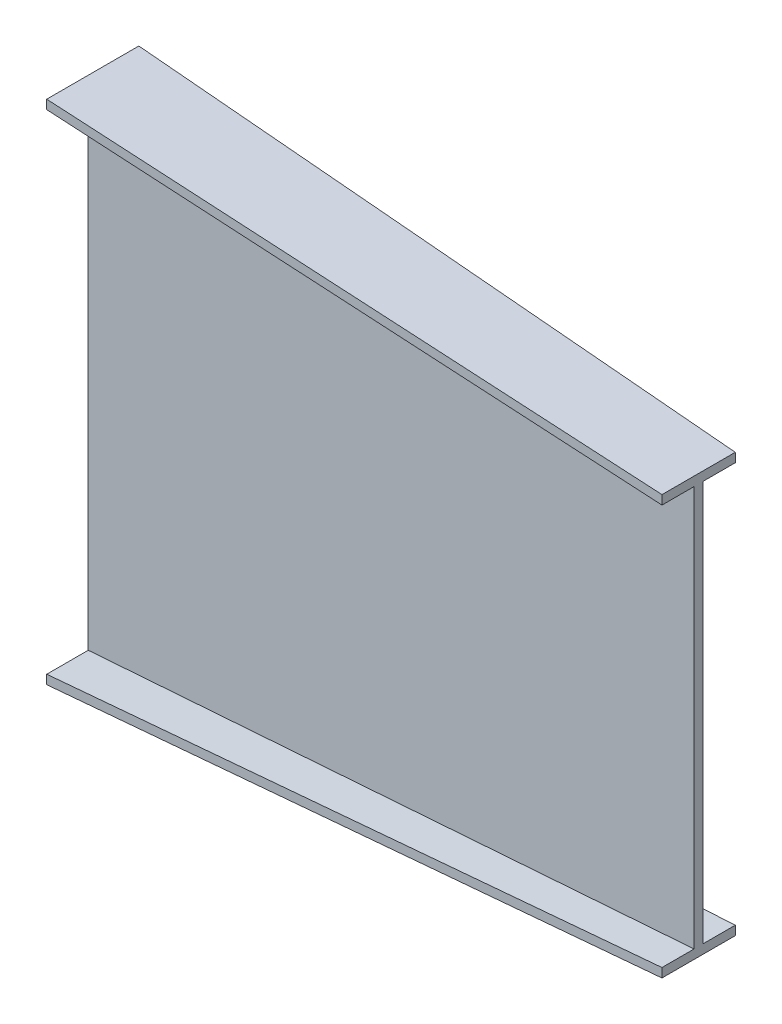
ISO-10303-21;
HEADER;
FILE_DESCRIPTION(('STEP AP214'),'2;1');
FILE_NAME('part.step','',(''),(''),'','','');
FILE_SCHEMA(('AUTOMOTIVE_DESIGN { 1 0 10303 214 1 1 1 1 }'));
ENDSEC;
DATA;
#1=APPLICATION_CONTEXT('core data for automotive mechanical design processes');
#2=APPLICATION_PROTOCOL_DEFINITION('international standard','automotive_design',2000,#1);
#3=PRODUCT_CONTEXT('',#1,'mechanical');
#4=PRODUCT('Part','Part','',(#3));
#5=PRODUCT_RELATED_PRODUCT_CATEGORY('part','',(#4));
#6=PRODUCT_DEFINITION_FORMATION('','',#4);
#7=PRODUCT_DEFINITION_CONTEXT('part definition',#1,'design');
#8=PRODUCT_DEFINITION('design','',#6,#7);
#9=PRODUCT_DEFINITION_SHAPE('','',#8);
#10=(LENGTH_UNIT() NAMED_UNIT(*) SI_UNIT(.MILLI.,.METRE.));
#11=(NAMED_UNIT(*) PLANE_ANGLE_UNIT() SI_UNIT($,.RADIAN.));
#12=(NAMED_UNIT(*) SI_UNIT($,.STERADIAN.) SOLID_ANGLE_UNIT());
#13=UNCERTAINTY_MEASURE_WITH_UNIT(LENGTH_MEASURE(1.E-05),#10,'distance_accuracy_value','');
#14=(GEOMETRIC_REPRESENTATION_CONTEXT(3) GLOBAL_UNCERTAINTY_ASSIGNED_CONTEXT((#13)) GLOBAL_UNIT_ASSIGNED_CONTEXT((#10,
#11,#12)) REPRESENTATION_CONTEXT('',''));
#15=CARTESIAN_POINT('',(0.,0.,0.));
#16=DIRECTION('',(0.,0.,1.));
#17=DIRECTION('',(1.,0.,0.));
#18=AXIS2_PLACEMENT_3D('',#15,#16,#17);
#19=CARTESIAN_POINT('',(1000.,0.,0.));
#20=DIRECTION('',(-1.,0.,0.));
#21=DIRECTION('',(0.,0.,1.));
#22=AXIS2_PLACEMENT_3D('',#19,#20,#21);
#23=PLANE('',#22);
#24=DIRECTION('',(0.,-1.,0.));
#25=VECTOR('',#24,1.);
#26=CARTESIAN_POINT('',(1000.,345.5,-52.9999999999995));
#27=LINE('',#26,#25);
#28=CARTESIAN_POINT('',(1000.,345.5,-52.9999999999995));
#29=VERTEX_POINT('',#28);
#30=CARTESIAN_POINT('',(1000.,330.5,-52.9999999999995));
#31=VERTEX_POINT('',#30);
#32=EDGE_CURVE('E375',#29,#31,#27,.T.);
#33=ORIENTED_EDGE('',*,*,#32,.F.);
#34=DIRECTION('',(0.,0.,-1.));
#35=VECTOR('',#34,1.);
#36=CARTESIAN_POINT('',(1000.,345.5,-52.9999999999995));
#37=LINE('',#36,#35);
#38=CARTESIAN_POINT('',(1000.,345.5,68.0000000000005));
#39=VERTEX_POINT('',#38);
#40=EDGE_CURVE('E12',#39,#29,#37,.T.);
#41=ORIENTED_EDGE('',*,*,#40,.F.);
#42=DIRECTION('',(0.,1.,0.));
#43=VECTOR('',#42,1.);
#44=CARTESIAN_POINT('',(1000.,345.5,68.0000000000005));
#45=LINE('',#44,#43);
#46=CARTESIAN_POINT('',(1000.,330.5,68.0000000000005));
#47=VERTEX_POINT('',#46);
#48=EDGE_CURVE('E69',#47,#39,#45,.T.);
#49=ORIENTED_EDGE('',*,*,#48,.F.);
#50=DIRECTION('',(0.,0.,1.));
#51=VECTOR('',#50,1.);
#52=CARTESIAN_POINT('',(1000.,330.5,15.0000000000003));
#53=LINE('',#52,#51);
#54=CARTESIAN_POINT('',(1000.,330.5,15.0000000000003));
#55=VERTEX_POINT('',#54);
#56=EDGE_CURVE('E650',#55,#47,#53,.T.);
#57=ORIENTED_EDGE('',*,*,#56,.F.);
#58=DIRECTION('',(0.,1.,0.));
#59=VECTOR('',#58,1.);
#60=CARTESIAN_POINT('',(1000.,330.5,15.0000000000003));
#61=LINE('',#60,#59);
#62=CARTESIAN_POINT('',(1000.,-330.5,15.0000000000003));
#63=VERTEX_POINT('',#62);
#64=EDGE_CURVE('E412',#63,#55,#61,.T.);
#65=ORIENTED_EDGE('',*,*,#64,.F.);
#66=DIRECTION('',(0.,0.,-1.));
#67=VECTOR('',#66,1.);
#68=CARTESIAN_POINT('',(1000.,-330.5,15.0000000000003));
#69=LINE('',#68,#67);
#70=CARTESIAN_POINT('',(1000.,-330.5,68.0000000000005));
#71=VERTEX_POINT('',#70);
#72=EDGE_CURVE('E426',#71,#63,#69,.T.);
#73=ORIENTED_EDGE('',*,*,#72,.F.);
#74=DIRECTION('',(0.,1.,0.));
#75=VECTOR('',#74,1.);
#76=CARTESIAN_POINT('',(1000.,-330.5,68.0000000000005));
#77=LINE('',#76,#75);
#78=CARTESIAN_POINT('',(1000.,-345.5,68.0000000000005));
#79=VERTEX_POINT('',#78);
#80=EDGE_CURVE('E440',#79,#71,#77,.T.);
#81=ORIENTED_EDGE('',*,*,#80,.F.);
#82=DIRECTION('',(0.,0.,1.));
#83=VECTOR('',#82,1.);
#84=CARTESIAN_POINT('',(1000.,-345.5,-52.9999999999995));
#85=LINE('',#84,#83);
#86=CARTESIAN_POINT('',(1000.,-345.5,-52.9999999999995));
#87=VERTEX_POINT('',#86);
#88=EDGE_CURVE('E621',#87,#79,#85,.T.);
#89=ORIENTED_EDGE('',*,*,#88,.F.);
#90=DIRECTION('',(0.,-1.,0.));
#91=VECTOR('',#90,1.);
#92=CARTESIAN_POINT('',(1000.,-330.5,-52.9999999999995));
#93=LINE('',#92,#91);
#94=CARTESIAN_POINT('',(1000.,-330.5,-52.9999999999995));
#95=VERTEX_POINT('',#94);
#96=EDGE_CURVE('E613',#95,#87,#93,.T.);
#97=ORIENTED_EDGE('',*,*,#96,.F.);
#98=DIRECTION('',(0.,0.,-1.));
#99=VECTOR('',#98,1.);
#100=CARTESIAN_POINT('',(1000.,-330.5,-52.9999999999995));
#101=LINE('',#100,#99);
#102=CARTESIAN_POINT('',(1000.,-330.5,4.44089209850063E-13));
#103=VERTEX_POINT('',#102);
#104=EDGE_CURVE('E528',#103,#95,#101,.T.);
#105=ORIENTED_EDGE('',*,*,#104,.F.);
#106=DIRECTION('',(0.,-1.,0.));
#107=VECTOR('',#106,1.);
#108=CARTESIAN_POINT('',(1000.,330.5,4.44089209850063E-13));
#109=LINE('',#108,#107);
#110=CARTESIAN_POINT('',(1000.,330.5,4.44089209850063E-13));
#111=VERTEX_POINT('',#110);
#112=EDGE_CURVE('E83',#111,#103,#109,.T.);
#113=ORIENTED_EDGE('',*,*,#112,.F.);
#114=DIRECTION('',(0.,0.,1.));
#115=VECTOR('',#114,1.);
#116=CARTESIAN_POINT('',(1000.,330.5,-52.9999999999995));
#117=LINE('',#116,#115);
#118=EDGE_CURVE('E77',#31,#111,#117,.T.);
#119=ORIENTED_EDGE('',*,*,#118,.F.);
#120=EDGE_LOOP('',(#33,#41,#49,#57,#65,#73,#81,#89,#97,#105,#113,#119));
#121=FACE_BOUND('',#120,.T.);
#122=ADVANCED_FACE('F59',(#121),#23,.F.);
#123=CARTESIAN_POINT('',(0.,0.,0.));
#124=DIRECTION('',(1.,0.,0.));
#125=DIRECTION('',(0.,0.,-1.));
#126=AXIS2_PLACEMENT_3D('',#123,#124,#125);
#127=PLANE('',#126);
#128=DIRECTION('',(0.,-1.,0.));
#129=VECTOR('',#128,1.);
#130=CARTESIAN_POINT('',(0.,418.5,83.5000000000004));
#131=LINE('',#130,#129);
#132=CARTESIAN_POINT('',(0.,418.5,83.5000000000004));
#133=VERTEX_POINT('',#132);
#134=CARTESIAN_POINT('',(0.,403.5,83.5000000000004));
#135=VERTEX_POINT('',#134);
#136=EDGE_CURVE('E158',#133,#135,#131,.T.);
#137=ORIENTED_EDGE('',*,*,#136,.F.);
#138=DIRECTION('',(0.,0.,1.));
#139=VECTOR('',#138,1.);
#140=CARTESIAN_POINT('',(0.,418.5,83.5000000000004));
#141=LINE('',#140,#139);
#142=CARTESIAN_POINT('',(0.,418.5,-68.4999999999996));
#143=VERTEX_POINT('',#142);
#144=EDGE_CURVE('E167',#143,#133,#141,.T.);
#145=ORIENTED_EDGE('',*,*,#144,.F.);
#146=DIRECTION('',(0.,1.,0.));
#147=VECTOR('',#146,1.);
#148=CARTESIAN_POINT('',(0.,418.5,-68.4999999999996));
#149=LINE('',#148,#147);
#150=CARTESIAN_POINT('',(0.,403.5,-68.4999999999996));
#151=VERTEX_POINT('',#150);
#152=EDGE_CURVE('E174',#151,#143,#149,.T.);
#153=ORIENTED_EDGE('',*,*,#152,.F.);
#154=DIRECTION('',(0.,0.,-1.));
#155=VECTOR('',#154,1.);
#156=CARTESIAN_POINT('',(0.,403.5,3.96180399283658E-13));
#157=LINE('',#156,#155);
#158=CARTESIAN_POINT('',(0.,403.5,3.96180399283658E-13));
#159=VERTEX_POINT('',#158);
#160=EDGE_CURVE('E298',#159,#151,#157,.T.);
#161=ORIENTED_EDGE('',*,*,#160,.F.);
#162=DIRECTION('',(0.,1.,0.));
#163=VECTOR('',#162,1.);
#164=CARTESIAN_POINT('',(0.,403.5,3.96180399283658E-13));
#165=LINE('',#164,#163);
#166=CARTESIAN_POINT('',(0.,-403.5,3.96180399283658E-13));
#167=VERTEX_POINT('',#166);
#168=EDGE_CURVE('E294',#167,#159,#165,.T.);
#169=ORIENTED_EDGE('',*,*,#168,.F.);
#170=DIRECTION('',(0.,0.,1.));
#171=VECTOR('',#170,1.);
#172=CARTESIAN_POINT('',(0.,-403.5,3.96180399283658E-13));
#173=LINE('',#172,#171);
#174=CARTESIAN_POINT('',(0.,-403.5,-68.4999999999999));
#175=VERTEX_POINT('',#174);
#176=EDGE_CURVE('E290',#175,#167,#173,.T.);
#177=ORIENTED_EDGE('',*,*,#176,.F.);
#178=DIRECTION('',(0.,1.,0.));
#179=VECTOR('',#178,1.);
#180=CARTESIAN_POINT('',(0.,-403.5,-68.4999999999999));
#181=LINE('',#180,#179);
#182=CARTESIAN_POINT('',(0.,-418.5,-68.4999999999998));
#183=VERTEX_POINT('',#182);
#184=EDGE_CURVE('E286',#183,#175,#181,.T.);
#185=ORIENTED_EDGE('',*,*,#184,.F.);
#186=DIRECTION('',(0.,0.,-1.));
#187=VECTOR('',#186,1.);
#188=CARTESIAN_POINT('',(0.,-418.5,83.5000000000001));
#189=LINE('',#188,#187);
#190=CARTESIAN_POINT('',(0.,-418.5,83.5000000000001));
#191=VERTEX_POINT('',#190);
#192=EDGE_CURVE('E282',#191,#183,#189,.T.);
#193=ORIENTED_EDGE('',*,*,#192,.F.);
#194=DIRECTION('',(0.,-1.,0.));
#195=VECTOR('',#194,1.);
#196=CARTESIAN_POINT('',(0.,-403.5,83.5000000000002));
#197=LINE('',#196,#195);
#198=CARTESIAN_POINT('',(0.,-403.5,83.5000000000002));
#199=VERTEX_POINT('',#198);
#200=EDGE_CURVE('E278',#199,#191,#197,.T.);
#201=ORIENTED_EDGE('',*,*,#200,.F.);
#202=DIRECTION('',(0.,0.,1.));
#203=VECTOR('',#202,1.);
#204=CARTESIAN_POINT('',(0.,-403.5,83.5000000000002));
#205=LINE('',#204,#203);
#206=CARTESIAN_POINT('',(0.,-403.5,15.0000000000004));
#207=VERTEX_POINT('',#206);
#208=EDGE_CURVE('E273',#207,#199,#205,.T.);
#209=ORIENTED_EDGE('',*,*,#208,.F.);
#210=DIRECTION('',(0.,-1.,0.));
#211=VECTOR('',#210,1.);
#212=CARTESIAN_POINT('',(0.,403.5,15.0000000000004));
#213=LINE('',#212,#211);
#214=CARTESIAN_POINT('',(0.,403.5,15.0000000000004));
#215=VERTEX_POINT('',#214);
#216=EDGE_CURVE('E271',#215,#207,#213,.T.);
#217=ORIENTED_EDGE('',*,*,#216,.F.);
#218=DIRECTION('',(0.,0.,-1.));
#219=VECTOR('',#218,1.);
#220=CARTESIAN_POINT('',(0.,403.5,83.5000000000004));
#221=LINE('',#220,#219);
#222=EDGE_CURVE('E180',#135,#215,#221,.T.);
#223=ORIENTED_EDGE('',*,*,#222,.F.);
#224=EDGE_LOOP('',(#137,#145,#153,#161,#169,#177,#185,#193,#201,#209,#217,#223));
#225=FACE_BOUND('',#224,.T.);
#226=ADVANCED_FACE('F178',(#225),#127,.F.);
#227=CARTESIAN_POINT('',(0.,0.,15.0000000000004));
#228=DIRECTION('',(0.,0.,1.));
#229=DIRECTION('',(1.,0.,0.));
#230=AXIS2_PLACEMENT_3D('',#227,#228,#229);
#231=PLANE('',#230);
#232=DIRECTION('',(0.997346102267893,0.0728062654655562,0.));
#233=VECTOR('',#232,1.);
#234=CARTESIAN_POINT('',(0.,-403.5,15.0000000000004));
#235=LINE('',#234,#233);
#236=EDGE_CURVE('E173',#207,#63,#235,.T.);
#237=ORIENTED_EDGE('',*,*,#236,.T.);
#238=ORIENTED_EDGE('',*,*,#64,.T.);
#239=DIRECTION('',(0.997346102267893,-0.0728062654655562,0.));
#240=VECTOR('',#239,1.);
#241=CARTESIAN_POINT('',(0.,403.5,15.0000000000004));
#242=LINE('',#241,#240);
#243=EDGE_CURVE('E385',#215,#55,#242,.T.);
#244=ORIENTED_EDGE('',*,*,#243,.F.);
#245=ORIENTED_EDGE('',*,*,#216,.T.);
#246=EDGE_LOOP('',(#237,#238,#244,#245));
#247=FACE_BOUND('',#246,.T.);
#248=ADVANCED_FACE('F201',(#247),#231,.T.);
#249=CARTESIAN_POINT('',(29.2993636908913,401.361146450565,0.));
#250=DIRECTION('',(-0.0728062654655562,-0.997346102267893,0.));
#251=DIRECTION('',(0.997346102267893,-0.0728062654655562,0.));
#252=AXIS2_PLACEMENT_3D('',#249,#250,#251);
#253=PLANE('',#252);
#254=ORIENTED_EDGE('',*,*,#243,.T.);
#255=ORIENTED_EDGE('',*,*,#56,.T.);
#256=DIRECTION('',(0.997226952485423,-0.0727975675314359,-0.0154570177635239));
#257=VECTOR('',#256,1.);
#258=CARTESIAN_POINT('',(0.,403.5,83.5000000000004));
#259=LINE('',#258,#257);
#260=EDGE_CURVE('E163',#135,#47,#259,.T.);
#261=ORIENTED_EDGE('',*,*,#260,.F.);
#262=ORIENTED_EDGE('',*,*,#222,.T.);
#263=EDGE_LOOP('',(#254,#255,#261,#262));
#264=FACE_BOUND('',#263,.T.);
#265=ADVANCED_FACE('F387',(#264),#253,.T.);
#266=CARTESIAN_POINT('',(29.2993636908912,-401.361146450565,0.));
#267=DIRECTION('',(-0.0728062654655562,0.997346102267893,0.));
#268=DIRECTION('',(-0.997346102267893,-0.0728062654655562,0.));
#269=AXIS2_PLACEMENT_3D('',#266,#267,#268);
#270=PLANE('',#269);
#271=DIRECTION('',(0.997226952485423,0.0727975675314359,-0.0154570177635237));
#272=VECTOR('',#271,1.);
#273=CARTESIAN_POINT('',(0.,-403.5,83.5000000000002));
#274=LINE('',#273,#272);
#275=EDGE_CURVE('E473',#199,#71,#274,.T.);
#276=ORIENTED_EDGE('',*,*,#275,.T.);
#277=ORIENTED_EDGE('',*,*,#72,.T.);
#278=ORIENTED_EDGE('',*,*,#236,.F.);
#279=ORIENTED_EDGE('',*,*,#208,.T.);
#280=EDGE_LOOP('',(#276,#277,#278,#279));
#281=FACE_BOUND('',#280,.T.);
#282=ADVANCED_FACE('F396',(#281),#270,.T.);
#283=CARTESIAN_POINT('',(1.29393913112372,0.,83.4799439434677));
#284=DIRECTION('',(0.0154981383979303,0.,0.999879896640691));
#285=DIRECTION('',(0.999879896640691,0.,-0.0154981383979303));
#286=AXIS2_PLACEMENT_3D('',#283,#284,#285);
#287=PLANE('',#286);
#288=DIRECTION('',(0.997226952485423,0.0727975675314359,-0.0154570177635237));
#289=VECTOR('',#288,1.);
#290=CARTESIAN_POINT('',(0.,-418.5,83.5000000000001));
#291=LINE('',#290,#289);
#292=EDGE_CURVE('E465',#191,#79,#291,.T.);
#293=ORIENTED_EDGE('',*,*,#292,.T.);
#294=ORIENTED_EDGE('',*,*,#80,.T.);
#295=ORIENTED_EDGE('',*,*,#275,.F.);
#296=ORIENTED_EDGE('',*,*,#200,.T.);
#297=EDGE_LOOP('',(#293,#294,#295,#296));
#298=FACE_BOUND('',#297,.T.);
#299=ADVANCED_FACE('F446',(#298),#287,.T.);
#300=CARTESIAN_POINT('',(30.3885593671325,-416.281635166199,0.));
#301=DIRECTION('',(0.0728062654655562,-0.997346102267893,0.));
#302=DIRECTION('',(0.997346102267893,0.0728062654655562,0.));
#303=AXIS2_PLACEMENT_3D('',#300,#301,#302);
#304=PLANE('',#303);
#305=DIRECTION('',(0.997226952485423,0.0727975675314358,0.0154570177635244));
#306=VECTOR('',#305,1.);
#307=CARTESIAN_POINT('',(0.,-418.5,-68.4999999999998));
#308=LINE('',#307,#306);
#309=EDGE_CURVE('E472',#183,#87,#308,.T.);
#310=ORIENTED_EDGE('',*,*,#309,.T.);
#311=ORIENTED_EDGE('',*,*,#88,.T.);
#312=ORIENTED_EDGE('',*,*,#292,.F.);
#313=ORIENTED_EDGE('',*,*,#192,.T.);
#314=EDGE_LOOP('',(#310,#311,#312,#313));
#315=FACE_BOUND('',#314,.T.);
#316=ADVANCED_FACE('F455',(#315),#304,.T.);
#317=CARTESIAN_POINT('',(1.06149497583208,0.,-68.4835468278745));
#318=DIRECTION('',(0.0154981383979311,0.,-0.999879896640691));
#319=DIRECTION('',(-0.999879896640691,0.,-0.0154981383979311));
#320=AXIS2_PLACEMENT_3D('',#317,#318,#319);
#321=PLANE('',#320);
#322=DIRECTION('',(0.997226952485423,0.0727975675314358,0.0154570177635244));
#323=VECTOR('',#322,1.);
#324=CARTESIAN_POINT('',(0.,-403.5,-68.4999999999999));
#325=LINE('',#324,#323);
#326=EDGE_CURVE('E490',#175,#95,#325,.T.);
#327=ORIENTED_EDGE('',*,*,#326,.T.);
#328=ORIENTED_EDGE('',*,*,#96,.T.);
#329=ORIENTED_EDGE('',*,*,#309,.F.);
#330=ORIENTED_EDGE('',*,*,#184,.T.);
#331=EDGE_LOOP('',(#327,#328,#329,#330));
#332=FACE_BOUND('',#331,.T.);
#333=ADVANCED_FACE('F501',(#332),#321,.T.);
#334=CARTESIAN_POINT('',(29.2993636908913,-401.361146450565,0.));
#335=DIRECTION('',(-0.0728062654655562,0.997346102267893,0.));
#336=DIRECTION('',(-0.997346102267893,-0.0728062654655562,0.));
#337=AXIS2_PLACEMENT_3D('',#334,#335,#336);
#338=PLANE('',#337);
#339=DIRECTION('',(0.997346102267893,0.0728062654655562,0.));
#340=VECTOR('',#339,1.);
#341=CARTESIAN_POINT('',(0.,-403.5,3.96180399283658E-13));
#342=LINE('',#341,#340);
#343=EDGE_CURVE('E567',#167,#103,#342,.T.);
#344=ORIENTED_EDGE('',*,*,#343,.T.);
#345=ORIENTED_EDGE('',*,*,#104,.T.);
#346=ORIENTED_EDGE('',*,*,#326,.F.);
#347=ORIENTED_EDGE('',*,*,#176,.T.);
#348=EDGE_LOOP('',(#344,#345,#346,#347));
#349=FACE_BOUND('',#348,.T.);
#350=ADVANCED_FACE('F510',(#349),#338,.T.);
#351=CARTESIAN_POINT('',(0.,0.,3.96180399283658E-13));
#352=DIRECTION('',(0.,0.,-1.));
#353=DIRECTION('',(-1.,0.,0.));
#354=AXIS2_PLACEMENT_3D('',#351,#352,#353);
#355=PLANE('',#354);
#356=DIRECTION('',(0.997346102267893,-0.0728062654655562,0.));
#357=VECTOR('',#356,1.);
#358=CARTESIAN_POINT('',(0.,403.5,3.96180399283658E-13));
#359=LINE('',#358,#357);
#360=EDGE_CURVE('E559',#159,#111,#359,.T.);
#361=ORIENTED_EDGE('',*,*,#360,.T.);
#362=ORIENTED_EDGE('',*,*,#112,.T.);
#363=ORIENTED_EDGE('',*,*,#343,.F.);
#364=ORIENTED_EDGE('',*,*,#168,.T.);
#365=EDGE_LOOP('',(#361,#362,#363,#364));
#366=FACE_BOUND('',#365,.T.);
#367=ADVANCED_FACE('F544',(#366),#355,.T.);
#368=CARTESIAN_POINT('',(29.2993636908913,401.361146450565,0.));
#369=DIRECTION('',(-0.0728062654655563,-0.997346102267893,0.));
#370=DIRECTION('',(0.997346102267893,-0.0728062654655563,0.));
#371=AXIS2_PLACEMENT_3D('',#368,#369,#370);
#372=PLANE('',#371);
#373=DIRECTION('',(0.997226952485423,-0.0727975675314359,0.0154570177635242));
#374=VECTOR('',#373,1.);
#375=CARTESIAN_POINT('',(0.,403.5,-68.4999999999996));
#376=LINE('',#375,#374);
#377=EDGE_CURVE('E566',#151,#31,#376,.T.);
#378=ORIENTED_EDGE('',*,*,#377,.T.);
#379=ORIENTED_EDGE('',*,*,#118,.T.);
#380=ORIENTED_EDGE('',*,*,#360,.F.);
#381=ORIENTED_EDGE('',*,*,#160,.T.);
#382=EDGE_LOOP('',(#378,#379,#380,#381));
#383=FACE_BOUND('',#382,.T.);
#384=ADVANCED_FACE('F325',(#383),#372,.T.);
#385=CARTESIAN_POINT('',(1.06149497583206,0.,-68.4835468278742));
#386=DIRECTION('',(0.0154981383979308,0.,-0.999879896640691));
#387=DIRECTION('',(-0.999879896640691,0.,-0.0154981383979308));
#388=AXIS2_PLACEMENT_3D('',#385,#386,#387);
#389=PLANE('',#388);
#390=DIRECTION('',(0.997226952485423,-0.0727975675314359,0.0154570177635242));
#391=VECTOR('',#390,1.);
#392=CARTESIAN_POINT('',(0.,418.5,-68.4999999999996));
#393=LINE('',#392,#391);
#394=EDGE_CURVE('E164',#143,#29,#393,.T.);
#395=ORIENTED_EDGE('',*,*,#394,.T.);
#396=ORIENTED_EDGE('',*,*,#32,.T.);
#397=ORIENTED_EDGE('',*,*,#377,.F.);
#398=ORIENTED_EDGE('',*,*,#152,.T.);
#399=EDGE_LOOP('',(#395,#396,#397,#398));
#400=FACE_BOUND('',#399,.T.);
#401=ADVANCED_FACE('F315',(#400),#389,.T.);
#402=CARTESIAN_POINT('',(30.3885593671326,416.281635166199,0.));
#403=DIRECTION('',(0.0728062654655562,0.997346102267893,0.));
#404=DIRECTION('',(-0.997346102267893,0.0728062654655562,0.));
#405=AXIS2_PLACEMENT_3D('',#402,#403,#404);
#406=PLANE('',#405);
#407=DIRECTION('',(0.997226952485423,-0.0727975675314359,-0.0154570177635239));
#408=VECTOR('',#407,1.);
#409=CARTESIAN_POINT('',(0.,418.5,83.5000000000004));
#410=LINE('',#409,#408);
#411=EDGE_CURVE('E153',#133,#39,#410,.T.);
#412=ORIENTED_EDGE('',*,*,#411,.T.);
#413=ORIENTED_EDGE('',*,*,#40,.T.);
#414=ORIENTED_EDGE('',*,*,#394,.F.);
#415=ORIENTED_EDGE('',*,*,#144,.T.);
#416=EDGE_LOOP('',(#412,#413,#414,#415));
#417=FACE_BOUND('',#416,.T.);
#418=ADVANCED_FACE('F169',(#417),#406,.T.);
#419=CARTESIAN_POINT('',(1.29393913112374,0.,83.479943943468));
#420=DIRECTION('',(0.0154981383979306,0.,0.999879896640691));
#421=DIRECTION('',(0.999879896640691,0.,-0.0154981383979306));
#422=AXIS2_PLACEMENT_3D('',#419,#420,#421);
#423=PLANE('',#422);
#424=ORIENTED_EDGE('',*,*,#260,.T.);
#425=ORIENTED_EDGE('',*,*,#48,.T.);
#426=ORIENTED_EDGE('',*,*,#411,.F.);
#427=ORIENTED_EDGE('',*,*,#136,.T.);
#428=EDGE_LOOP('',(#424,#425,#426,#427));
#429=FACE_BOUND('',#428,.T.);
#430=ADVANCED_FACE('F156',(#429),#423,.T.);
#431=CLOSED_SHELL('',(#122,#226,#248,#265,#282,#299,#316,#333,#350,#367,#384,#401,#418,#430));
#432=MANIFOLD_SOLID_BREP('B2',#431);
#433=ADVANCED_BREP_SHAPE_REPRESENTATION('',(#18,#432),#14);
#434=SHAPE_DEFINITION_REPRESENTATION(#9,#433);
ENDSEC;
END-ISO-10303-21;
